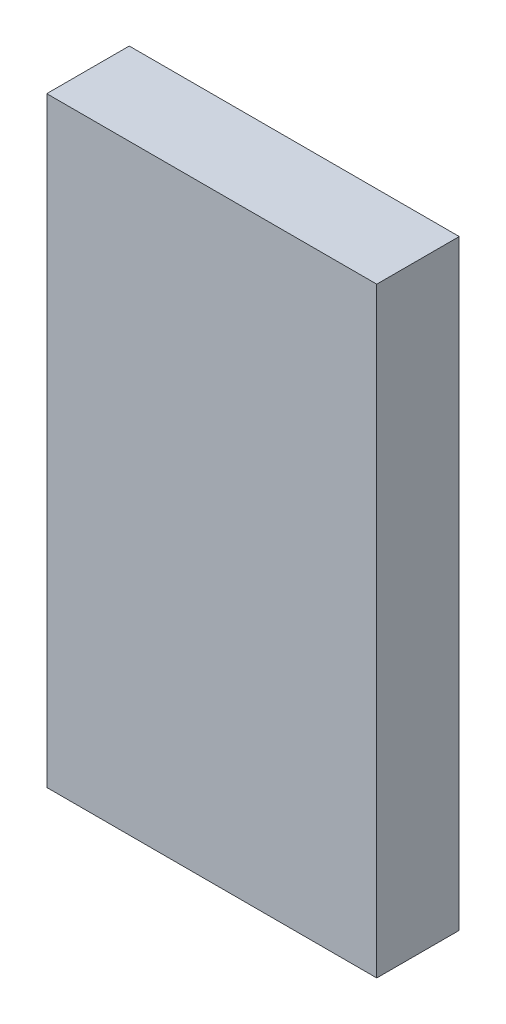
ISO-10303-21;
HEADER;
FILE_DESCRIPTION(('STEP AP214'),'2;1');
FILE_NAME('part.step','',(''),(''),'','','');
FILE_SCHEMA(('AUTOMOTIVE_DESIGN { 1 0 10303 214 1 1 1 1 }'));
ENDSEC;
DATA;
#1=APPLICATION_CONTEXT('core data for automotive mechanical design processes');
#2=APPLICATION_PROTOCOL_DEFINITION('international standard','automotive_design',2000,#1);
#3=PRODUCT_CONTEXT('',#1,'mechanical');
#4=PRODUCT('Part','Part','',(#3));
#5=PRODUCT_RELATED_PRODUCT_CATEGORY('part','',(#4));
#6=PRODUCT_DEFINITION_FORMATION('','',#4);
#7=PRODUCT_DEFINITION_CONTEXT('part definition',#1,'design');
#8=PRODUCT_DEFINITION('design','',#6,#7);
#9=PRODUCT_DEFINITION_SHAPE('','',#8);
#10=(LENGTH_UNIT() NAMED_UNIT(*) SI_UNIT(.MILLI.,.METRE.));
#11=(NAMED_UNIT(*) PLANE_ANGLE_UNIT() SI_UNIT($,.RADIAN.));
#12=(NAMED_UNIT(*) SI_UNIT($,.STERADIAN.) SOLID_ANGLE_UNIT());
#13=UNCERTAINTY_MEASURE_WITH_UNIT(LENGTH_MEASURE(1.E-05),#10,'distance_accuracy_value','');
#14=(GEOMETRIC_REPRESENTATION_CONTEXT(3) GLOBAL_UNCERTAINTY_ASSIGNED_CONTEXT((#13)) GLOBAL_UNIT_ASSIGNED_CONTEXT((#10,
#11,#12)) REPRESENTATION_CONTEXT('',''));
#15=CARTESIAN_POINT('',(0.,0.,0.));
#16=DIRECTION('',(0.,0.,1.));
#17=DIRECTION('',(1.,0.,0.));
#18=AXIS2_PLACEMENT_3D('',#15,#16,#17);
#19=CARTESIAN_POINT('',(5.08,18.5,1.27));
#20=DIRECTION('',(-1.,0.,0.));
#21=DIRECTION('',(0.,0.,1.));
#22=AXIS2_PLACEMENT_3D('',#19,#20,#21);
#23=PLANE('',#22);
#24=DIRECTION('',(0.,0.,-1.));
#25=VECTOR('',#24,1.);
#26=CARTESIAN_POINT('',(5.08,0.,1.27));
#27=LINE('',#26,#25);
#28=CARTESIAN_POINT('',(5.08,0.,1.27));
#29=VERTEX_POINT('',#28);
#30=CARTESIAN_POINT('',(5.08,0.,-1.27));
#31=VERTEX_POINT('',#30);
#32=EDGE_CURVE('E96',#29,#31,#27,.T.);
#33=ORIENTED_EDGE('',*,*,#32,.T.);
#34=DIRECTION('',(0.,-1.,0.));
#35=VECTOR('',#34,1.);
#36=CARTESIAN_POINT('',(5.08,18.5,-1.27));
#37=LINE('',#36,#35);
#38=CARTESIAN_POINT('',(5.08,18.5,-1.27));
#39=VERTEX_POINT('',#38);
#40=EDGE_CURVE('E11',#39,#31,#37,.T.);
#41=ORIENTED_EDGE('',*,*,#40,.F.);
#42=DIRECTION('',(0.,0.,-1.));
#43=VECTOR('',#42,1.);
#44=CARTESIAN_POINT('',(5.08,18.5,1.27));
#45=LINE('',#44,#43);
#46=CARTESIAN_POINT('',(5.08,18.5,1.27));
#47=VERTEX_POINT('',#46);
#48=EDGE_CURVE('E84',#47,#39,#45,.T.);
#49=ORIENTED_EDGE('',*,*,#48,.F.);
#50=DIRECTION('',(0.,-1.,0.));
#51=VECTOR('',#50,1.);
#52=CARTESIAN_POINT('',(5.08,18.5,1.27));
#53=LINE('',#52,#51);
#54=EDGE_CURVE('E92',#47,#29,#53,.T.);
#55=ORIENTED_EDGE('',*,*,#54,.T.);
#56=EDGE_LOOP('',(#33,#41,#49,#55));
#57=FACE_BOUND('',#56,.T.);
#58=ADVANCED_FACE('F33',(#57),#23,.F.);
#59=CARTESIAN_POINT('',(-5.08,18.5,-1.27));
#60=DIRECTION('',(0.,0.,1.));
#61=DIRECTION('',(1.,0.,0.));
#62=AXIS2_PLACEMENT_3D('',#59,#60,#61);
#63=PLANE('',#62);
#64=DIRECTION('',(-1.,0.,0.));
#65=VECTOR('',#64,1.);
#66=CARTESIAN_POINT('',(-5.08,0.,-1.27));
#67=LINE('',#66,#65);
#68=CARTESIAN_POINT('',(-5.08,0.,-1.27));
#69=VERTEX_POINT('',#68);
#70=EDGE_CURVE('E88',#31,#69,#67,.T.);
#71=ORIENTED_EDGE('',*,*,#70,.T.);
#72=DIRECTION('',(0.,-1.,0.));
#73=VECTOR('',#72,1.);
#74=CARTESIAN_POINT('',(-5.08,18.5,-1.27));
#75=LINE('',#74,#73);
#76=CARTESIAN_POINT('',(-5.08,18.5,-1.27));
#77=VERTEX_POINT('',#76);
#78=EDGE_CURVE('E41',#77,#69,#75,.T.);
#79=ORIENTED_EDGE('',*,*,#78,.F.);
#80=DIRECTION('',(-1.,0.,0.));
#81=VECTOR('',#80,1.);
#82=CARTESIAN_POINT('',(-5.08,18.5,-1.27));
#83=LINE('',#82,#81);
#84=EDGE_CURVE('E79',#39,#77,#83,.T.);
#85=ORIENTED_EDGE('',*,*,#84,.F.);
#86=ORIENTED_EDGE('',*,*,#40,.T.);
#87=EDGE_LOOP('',(#71,#79,#85,#86));
#88=FACE_BOUND('',#87,.T.);
#89=ADVANCED_FACE('F87',(#88),#63,.F.);
#90=CARTESIAN_POINT('',(-5.08,18.5,1.27));
#91=DIRECTION('',(1.,0.,0.));
#92=DIRECTION('',(0.,0.,-1.));
#93=AXIS2_PLACEMENT_3D('',#90,#91,#92);
#94=PLANE('',#93);
#95=DIRECTION('',(0.,0.,1.));
#96=VECTOR('',#95,1.);
#97=CARTESIAN_POINT('',(-5.08,0.,1.27));
#98=LINE('',#97,#96);
#99=CARTESIAN_POINT('',(-5.08,0.,1.27));
#100=VERTEX_POINT('',#99);
#101=EDGE_CURVE('E66',#69,#100,#98,.T.);
#102=ORIENTED_EDGE('',*,*,#101,.T.);
#103=DIRECTION('',(0.,-1.,0.));
#104=VECTOR('',#103,1.);
#105=CARTESIAN_POINT('',(-5.08,18.5,1.27));
#106=LINE('',#105,#104);
#107=CARTESIAN_POINT('',(-5.08,18.5,1.27));
#108=VERTEX_POINT('',#107);
#109=EDGE_CURVE('E89',#108,#100,#106,.T.);
#110=ORIENTED_EDGE('',*,*,#109,.F.);
#111=DIRECTION('',(0.,0.,1.));
#112=VECTOR('',#111,1.);
#113=CARTESIAN_POINT('',(-5.08,18.5,1.27));
#114=LINE('',#113,#112);
#115=EDGE_CURVE('E82',#77,#108,#114,.T.);
#116=ORIENTED_EDGE('',*,*,#115,.F.);
#117=ORIENTED_EDGE('',*,*,#78,.T.);
#118=EDGE_LOOP('',(#102,#110,#116,#117));
#119=FACE_BOUND('',#118,.T.);
#120=ADVANCED_FACE('F90',(#119),#94,.F.);
#121=CARTESIAN_POINT('',(-5.08,18.5,1.27));
#122=DIRECTION('',(0.,0.,-1.));
#123=DIRECTION('',(-1.,0.,0.));
#124=AXIS2_PLACEMENT_3D('',#121,#122,#123);
#125=PLANE('',#124);
#126=DIRECTION('',(1.,0.,0.));
#127=VECTOR('',#126,1.);
#128=CARTESIAN_POINT('',(-5.08,0.,1.27));
#129=LINE('',#128,#127);
#130=EDGE_CURVE('E72',#100,#29,#129,.T.);
#131=ORIENTED_EDGE('',*,*,#130,.T.);
#132=ORIENTED_EDGE('',*,*,#54,.F.);
#133=DIRECTION('',(1.,0.,0.));
#134=VECTOR('',#133,1.);
#135=CARTESIAN_POINT('',(-5.08,18.5,1.27));
#136=LINE('',#135,#134);
#137=EDGE_CURVE('E49',#108,#47,#136,.T.);
#138=ORIENTED_EDGE('',*,*,#137,.F.);
#139=ORIENTED_EDGE('',*,*,#109,.T.);
#140=EDGE_LOOP('',(#131,#132,#138,#139));
#141=FACE_BOUND('',#140,.T.);
#142=ADVANCED_FACE('F103',(#141),#125,.F.);
#143=CARTESIAN_POINT('',(0.,18.5,0.));
#144=DIRECTION('',(0.,-1.,0.));
#145=DIRECTION('',(0.,0.,-1.));
#146=AXIS2_PLACEMENT_3D('',#143,#144,#145);
#147=PLANE('',#146);
#148=ORIENTED_EDGE('',*,*,#48,.T.);
#149=ORIENTED_EDGE('',*,*,#84,.T.);
#150=ORIENTED_EDGE('',*,*,#115,.T.);
#151=ORIENTED_EDGE('',*,*,#137,.T.);
#152=EDGE_LOOP('',(#148,#149,#150,#151));
#153=FACE_BOUND('',#152,.T.);
#154=ADVANCED_FACE('F80',(#153),#147,.F.);
#155=CARTESIAN_POINT('',(0.,0.,0.));
#156=DIRECTION('',(0.,-1.,0.));
#157=DIRECTION('',(0.,0.,-1.));
#158=AXIS2_PLACEMENT_3D('',#155,#156,#157);
#159=PLANE('',#158);
#160=ORIENTED_EDGE('',*,*,#32,.F.);
#161=ORIENTED_EDGE('',*,*,#130,.F.);
#162=ORIENTED_EDGE('',*,*,#101,.F.);
#163=ORIENTED_EDGE('',*,*,#70,.F.);
#164=EDGE_LOOP('',(#160,#161,#162,#163));
#165=FACE_BOUND('',#164,.T.);
#166=ADVANCED_FACE('F106',(#165),#159,.T.);
#167=CLOSED_SHELL('',(#58,#89,#120,#142,#154,#166));
#168=MANIFOLD_SOLID_BREP('B2',#167);
#169=ADVANCED_BREP_SHAPE_REPRESENTATION('',(#18,#168),#14);
#170=SHAPE_DEFINITION_REPRESENTATION(#9,#169);
ENDSEC;
END-ISO-10303-21;
